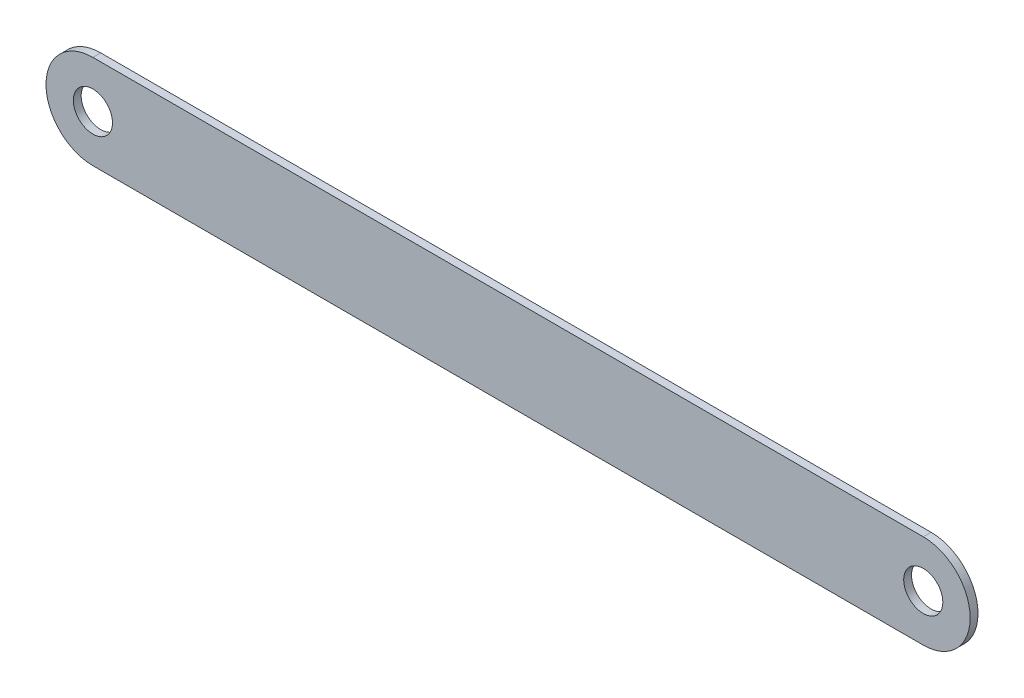
ISO-10303-21;
HEADER;
FILE_DESCRIPTION(('STEP AP214'),'2;1');
FILE_NAME('part.step','',(''),(''),'','','');
FILE_SCHEMA(('AUTOMOTIVE_DESIGN { 1 0 10303 214 1 1 1 1 }'));
ENDSEC;
DATA;
#1=APPLICATION_CONTEXT('core data for automotive mechanical design processes');
#2=APPLICATION_PROTOCOL_DEFINITION('international standard','automotive_design',2000,#1);
#3=PRODUCT_CONTEXT('',#1,'mechanical');
#4=PRODUCT('Part','Part','',(#3));
#5=PRODUCT_RELATED_PRODUCT_CATEGORY('part','',(#4));
#6=PRODUCT_DEFINITION_FORMATION('','',#4);
#7=PRODUCT_DEFINITION_CONTEXT('part definition',#1,'design');
#8=PRODUCT_DEFINITION('design','',#6,#7);
#9=PRODUCT_DEFINITION_SHAPE('','',#8);
#10=(LENGTH_UNIT() NAMED_UNIT(*) SI_UNIT(.MILLI.,.METRE.));
#11=(NAMED_UNIT(*) PLANE_ANGLE_UNIT() SI_UNIT($,.RADIAN.));
#12=(NAMED_UNIT(*) SI_UNIT($,.STERADIAN.) SOLID_ANGLE_UNIT());
#13=UNCERTAINTY_MEASURE_WITH_UNIT(LENGTH_MEASURE(1.E-05),#10,'distance_accuracy_value','');
#14=(GEOMETRIC_REPRESENTATION_CONTEXT(3) GLOBAL_UNCERTAINTY_ASSIGNED_CONTEXT((#13)) GLOBAL_UNIT_ASSIGNED_CONTEXT((#10,
#11,#12)) REPRESENTATION_CONTEXT('',''));
#15=CARTESIAN_POINT('',(0.,0.,0.));
#16=DIRECTION('',(0.,0.,1.));
#17=DIRECTION('',(1.,0.,0.));
#18=AXIS2_PLACEMENT_3D('',#15,#16,#17);
#19=CARTESIAN_POINT('',(-53.09,0.,0.));
#20=DIRECTION('',(0.,0.,-1.));
#21=DIRECTION('',(-1.,0.,0.));
#22=AXIS2_PLACEMENT_3D('',#19,#20,#21);
#23=CYLINDRICAL_SURFACE('',#22,6.00000000000001);
#24=DIRECTION('',(0.,0.,-1.));
#25=VECTOR('',#24,1.);
#26=CARTESIAN_POINT('',(-53.09,6.,1.));
#27=LINE('',#26,#25);
#28=CARTESIAN_POINT('',(-53.09,6.,0.));
#29=VERTEX_POINT('',#28);
#30=CARTESIAN_POINT('',(-53.09,6.,1.));
#31=VERTEX_POINT('',#30);
#32=EDGE_CURVE('E80',#29,#31,#27,.F.);
#33=ORIENTED_EDGE('',*,*,#32,.F.);
#34=CARTESIAN_POINT('',(-53.09,0.,0.));
#35=DIRECTION('',(0.,0.,1.));
#36=DIRECTION('',(1.,0.,0.));
#37=AXIS2_PLACEMENT_3D('',#34,#35,#36);
#38=CIRCLE('',#37,6.00000000000001);
#39=CARTESIAN_POINT('',(-53.09,-6.,0.));
#40=VERTEX_POINT('',#39);
#41=EDGE_CURVE('E38',#40,#29,#38,.F.);
#42=ORIENTED_EDGE('',*,*,#41,.F.);
#43=DIRECTION('',(0.,0.,-1.));
#44=VECTOR('',#43,1.);
#45=CARTESIAN_POINT('',(-53.09,-6.,1.));
#46=LINE('',#45,#44);
#47=CARTESIAN_POINT('',(-53.09,-6.,1.));
#48=VERTEX_POINT('',#47);
#49=EDGE_CURVE('E103',#48,#40,#46,.T.);
#50=ORIENTED_EDGE('',*,*,#49,.F.);
#51=CARTESIAN_POINT('',(-53.09,0.,1.));
#52=DIRECTION('',(0.,0.,1.));
#53=DIRECTION('',(1.,0.,0.));
#54=AXIS2_PLACEMENT_3D('',#51,#52,#53);
#55=CIRCLE('',#54,6.00000000000001);
#56=EDGE_CURVE('E11',#31,#48,#55,.T.);
#57=ORIENTED_EDGE('',*,*,#56,.F.);
#58=EDGE_LOOP('',(#33,#42,#50,#57));
#59=FACE_BOUND('',#58,.T.);
#60=ADVANCED_FACE('F31',(#59),#23,.T.);
#61=CARTESIAN_POINT('',(53.09,0.,1.));
#62=DIRECTION('',(0.,0.,-1.));
#63=DIRECTION('',(-1.,0.,0.));
#64=AXIS2_PLACEMENT_3D('',#61,#62,#63);
#65=CYLINDRICAL_SURFACE('',#64,6.);
#66=DIRECTION('',(0.,0.,-1.));
#67=VECTOR('',#66,1.);
#68=CARTESIAN_POINT('',(53.09,6.,1.));
#69=LINE('',#68,#67);
#70=CARTESIAN_POINT('',(53.09,6.,1.));
#71=VERTEX_POINT('',#70);
#72=CARTESIAN_POINT('',(53.09,6.,0.));
#73=VERTEX_POINT('',#72);
#74=EDGE_CURVE('E73',#71,#73,#69,.T.);
#75=ORIENTED_EDGE('',*,*,#74,.F.);
#76=CARTESIAN_POINT('',(53.09,0.,1.));
#77=DIRECTION('',(0.,0.,1.));
#78=DIRECTION('',(1.,0.,0.));
#79=AXIS2_PLACEMENT_3D('',#76,#77,#78);
#80=CIRCLE('',#79,6.);
#81=CARTESIAN_POINT('',(53.09,-6.,1.));
#82=VERTEX_POINT('',#81);
#83=EDGE_CURVE('E81',#82,#71,#80,.T.);
#84=ORIENTED_EDGE('',*,*,#83,.F.);
#85=DIRECTION('',(0.,0.,-1.));
#86=VECTOR('',#85,1.);
#87=CARTESIAN_POINT('',(53.09,-6.,1.));
#88=LINE('',#87,#86);
#89=CARTESIAN_POINT('',(53.09,-6.,0.));
#90=VERTEX_POINT('',#89);
#91=EDGE_CURVE('E76',#90,#82,#88,.F.);
#92=ORIENTED_EDGE('',*,*,#91,.F.);
#93=CARTESIAN_POINT('',(53.09,0.,0.));
#94=DIRECTION('',(0.,0.,1.));
#95=DIRECTION('',(1.,0.,0.));
#96=AXIS2_PLACEMENT_3D('',#93,#94,#95);
#97=CIRCLE('',#96,6.);
#98=EDGE_CURVE('E69',#73,#90,#97,.F.);
#99=ORIENTED_EDGE('',*,*,#98,.F.);
#100=EDGE_LOOP('',(#75,#84,#92,#99));
#101=FACE_BOUND('',#100,.T.);
#102=ADVANCED_FACE('F71',(#101),#65,.T.);
#103=CARTESIAN_POINT('',(-59.09,-6.,1.));
#104=DIRECTION('',(0.,0.,1.));
#105=DIRECTION('',(1.,0.,0.));
#106=AXIS2_PLACEMENT_3D('',#103,#104,#105);
#107=PLANE('',#106);
#108=CARTESIAN_POINT('',(-53.09,0.,1.));
#109=DIRECTION('',(0.,0.,1.));
#110=DIRECTION('',(1.,0.,0.));
#111=AXIS2_PLACEMENT_3D('',#108,#109,#110);
#112=CIRCLE('',#111,2.5);
#113=CARTESIAN_POINT('',(-50.59,0.,1.));
#114=VERTEX_POINT('',#113);
#115=EDGE_CURVE('E96',#114,#114,#112,.T.);
#116=ORIENTED_EDGE('',*,*,#115,.F.);
#117=EDGE_LOOP('',(#116));
#118=FACE_BOUND('',#117,.T.);
#119=DIRECTION('',(-1.,0.,0.));
#120=VECTOR('',#119,1.);
#121=CARTESIAN_POINT('',(-59.09,6.,1.));
#122=LINE('',#121,#120);
#123=EDGE_CURVE('E88',#71,#31,#122,.T.);
#124=ORIENTED_EDGE('',*,*,#123,.T.);
#125=ORIENTED_EDGE('',*,*,#56,.T.);
#126=DIRECTION('',(1.,0.,0.));
#127=VECTOR('',#126,1.);
#128=CARTESIAN_POINT('',(-59.09,-6.,1.));
#129=LINE('',#128,#127);
#130=EDGE_CURVE('E92',#48,#82,#129,.T.);
#131=ORIENTED_EDGE('',*,*,#130,.T.);
#132=ORIENTED_EDGE('',*,*,#83,.T.);
#133=EDGE_LOOP('',(#124,#125,#131,#132));
#134=FACE_BOUND('',#133,.T.);
#135=CARTESIAN_POINT('',(53.09,0.,1.));
#136=DIRECTION('',(0.,0.,1.));
#137=DIRECTION('',(1.,0.,0.));
#138=AXIS2_PLACEMENT_3D('',#135,#136,#137);
#139=CIRCLE('',#138,2.49999999999999);
#140=CARTESIAN_POINT('',(55.59,0.,1.));
#141=VERTEX_POINT('',#140);
#142=EDGE_CURVE('E113',#141,#141,#139,.T.);
#143=ORIENTED_EDGE('',*,*,#142,.F.);
#144=EDGE_LOOP('',(#143));
#145=FACE_BOUND('',#144,.T.);
#146=ADVANCED_FACE('F107',(#118,#134,#145),#107,.T.);
#147=CARTESIAN_POINT('',(-59.09,-6.,0.));
#148=DIRECTION('',(0.,0.,1.));
#149=DIRECTION('',(1.,0.,0.));
#150=AXIS2_PLACEMENT_3D('',#147,#148,#149);
#151=PLANE('',#150);
#152=CARTESIAN_POINT('',(-53.09,0.,0.));
#153=DIRECTION('',(0.,0.,1.));
#154=DIRECTION('',(1.,0.,0.));
#155=AXIS2_PLACEMENT_3D('',#152,#153,#154);
#156=CIRCLE('',#155,2.5);
#157=CARTESIAN_POINT('',(-50.59,0.,0.));
#158=VERTEX_POINT('',#157);
#159=EDGE_CURVE('E110',#158,#158,#156,.T.);
#160=ORIENTED_EDGE('',*,*,#159,.T.);
#161=EDGE_LOOP('',(#160));
#162=FACE_BOUND('',#161,.T.);
#163=DIRECTION('',(1.,0.,0.));
#164=VECTOR('',#163,1.);
#165=CARTESIAN_POINT('',(-59.09,-6.,0.));
#166=LINE('',#165,#164);
#167=EDGE_CURVE('E93',#40,#90,#166,.T.);
#168=ORIENTED_EDGE('',*,*,#167,.F.);
#169=ORIENTED_EDGE('',*,*,#41,.T.);
#170=DIRECTION('',(-1.,0.,0.));
#171=VECTOR('',#170,1.);
#172=CARTESIAN_POINT('',(-59.09,6.,0.));
#173=LINE('',#172,#171);
#174=EDGE_CURVE('E87',#73,#29,#173,.T.);
#175=ORIENTED_EDGE('',*,*,#174,.F.);
#176=ORIENTED_EDGE('',*,*,#98,.T.);
#177=EDGE_LOOP('',(#168,#169,#175,#176));
#178=FACE_BOUND('',#177,.T.);
#179=CARTESIAN_POINT('',(53.09,0.,0.));
#180=DIRECTION('',(0.,0.,1.));
#181=DIRECTION('',(1.,0.,0.));
#182=AXIS2_PLACEMENT_3D('',#179,#180,#181);
#183=CIRCLE('',#182,2.49999999999999);
#184=CARTESIAN_POINT('',(55.59,0.,0.));
#185=VERTEX_POINT('',#184);
#186=EDGE_CURVE('E116',#185,#185,#183,.T.);
#187=ORIENTED_EDGE('',*,*,#186,.T.);
#188=EDGE_LOOP('',(#187));
#189=FACE_BOUND('',#188,.T.);
#190=ADVANCED_FACE('F90',(#162,#178,#189),#151,.F.);
#191=CARTESIAN_POINT('',(-59.09,-6.,1.));
#192=DIRECTION('',(0.,1.,0.));
#193=DIRECTION('',(0.,0.,1.));
#194=AXIS2_PLACEMENT_3D('',#191,#192,#193);
#195=PLANE('',#194);
#196=ORIENTED_EDGE('',*,*,#130,.F.);
#197=ORIENTED_EDGE('',*,*,#49,.T.);
#198=ORIENTED_EDGE('',*,*,#167,.T.);
#199=ORIENTED_EDGE('',*,*,#91,.T.);
#200=EDGE_LOOP('',(#196,#197,#198,#199));
#201=FACE_BOUND('',#200,.T.);
#202=ADVANCED_FACE('F106',(#201),#195,.F.);
#203=CARTESIAN_POINT('',(-59.09,6.,1.));
#204=DIRECTION('',(0.,-1.,0.));
#205=DIRECTION('',(0.,0.,-1.));
#206=AXIS2_PLACEMENT_3D('',#203,#204,#205);
#207=PLANE('',#206);
#208=ORIENTED_EDGE('',*,*,#174,.T.);
#209=ORIENTED_EDGE('',*,*,#32,.T.);
#210=ORIENTED_EDGE('',*,*,#123,.F.);
#211=ORIENTED_EDGE('',*,*,#74,.T.);
#212=EDGE_LOOP('',(#208,#209,#210,#211));
#213=FACE_BOUND('',#212,.T.);
#214=ADVANCED_FACE('F85',(#213),#207,.F.);
#215=CARTESIAN_POINT('',(-53.09,0.,1.));
#216=DIRECTION('',(0.,0.,-1.));
#217=DIRECTION('',(-1.,0.,0.));
#218=AXIS2_PLACEMENT_3D('',#215,#216,#217);
#219=CYLINDRICAL_SURFACE('',#218,2.5);
#220=ORIENTED_EDGE('',*,*,#115,.T.);
#221=EDGE_LOOP('',(#220));
#222=FACE_BOUND('',#221,.T.);
#223=ORIENTED_EDGE('',*,*,#159,.F.);
#224=EDGE_LOOP('',(#223));
#225=FACE_BOUND('',#224,.T.);
#226=ADVANCED_FACE('F151',(#222,#225),#219,.F.);
#227=CARTESIAN_POINT('',(53.09,0.,1.));
#228=DIRECTION('',(0.,0.,-1.));
#229=DIRECTION('',(-1.,0.,0.));
#230=AXIS2_PLACEMENT_3D('',#227,#228,#229);
#231=CYLINDRICAL_SURFACE('',#230,2.49999999999999);
#232=ORIENTED_EDGE('',*,*,#142,.T.);
#233=EDGE_LOOP('',(#232));
#234=FACE_BOUND('',#233,.T.);
#235=ORIENTED_EDGE('',*,*,#186,.F.);
#236=EDGE_LOOP('',(#235));
#237=FACE_BOUND('',#236,.T.);
#238=ADVANCED_FACE('F122',(#234,#237),#231,.F.);
#239=CLOSED_SHELL('',(#60,#102,#146,#190,#202,#214,#226,#238));
#240=MANIFOLD_SOLID_BREP('B2',#239);
#241=ADVANCED_BREP_SHAPE_REPRESENTATION('',(#18,#240),#14);
#242=SHAPE_DEFINITION_REPRESENTATION(#9,#241);
ENDSEC;
END-ISO-10303-21;
